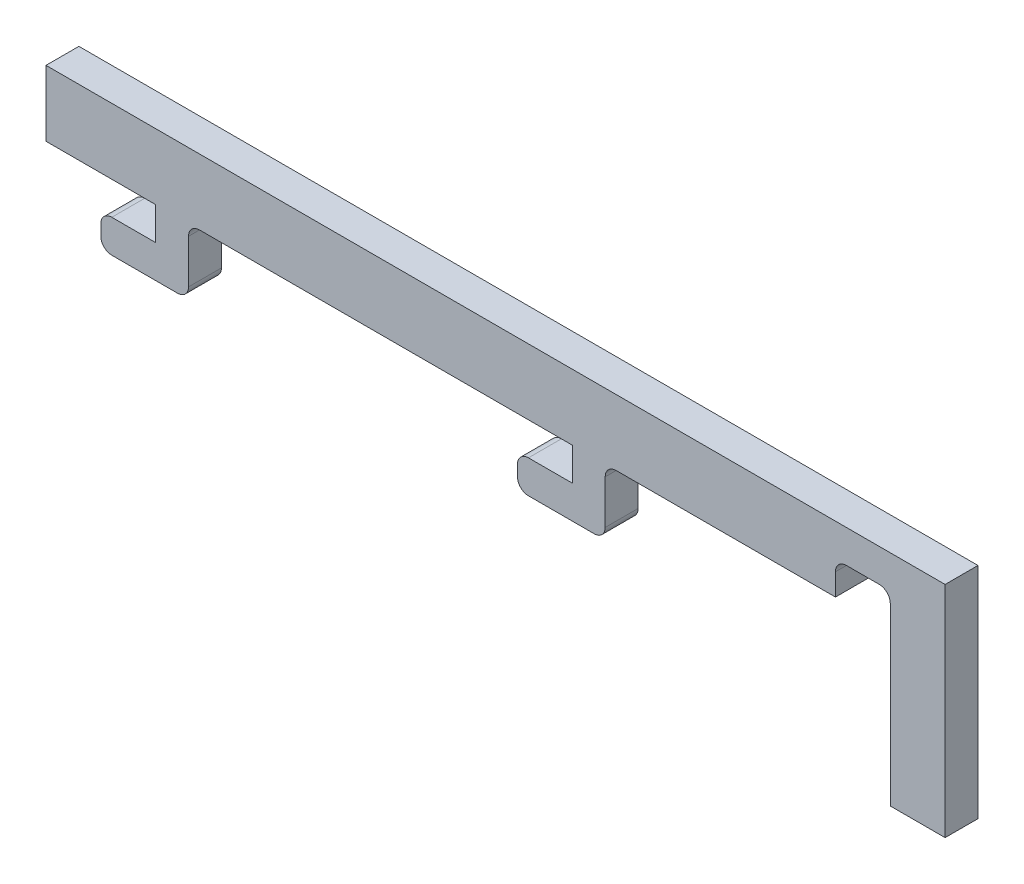
ISO-10303-21;
HEADER;
FILE_DESCRIPTION(('STEP AP214'),'2;1');
FILE_NAME('part.step','',(''),(''),'','','');
FILE_SCHEMA(('AUTOMOTIVE_DESIGN { 1 0 10303 214 1 1 1 1 }'));
ENDSEC;
DATA;
#1=APPLICATION_CONTEXT('core data for automotive mechanical design processes');
#2=APPLICATION_PROTOCOL_DEFINITION('international standard','automotive_design',2000,#1);
#3=PRODUCT_CONTEXT('',#1,'mechanical');
#4=PRODUCT('Part','Part','',(#3));
#5=PRODUCT_RELATED_PRODUCT_CATEGORY('part','',(#4));
#6=PRODUCT_DEFINITION_FORMATION('','',#4);
#7=PRODUCT_DEFINITION_CONTEXT('part definition',#1,'design');
#8=PRODUCT_DEFINITION('design','',#6,#7);
#9=PRODUCT_DEFINITION_SHAPE('','',#8);
#10=(LENGTH_UNIT() NAMED_UNIT(*) SI_UNIT(.MILLI.,.METRE.));
#11=(NAMED_UNIT(*) PLANE_ANGLE_UNIT() SI_UNIT($,.RADIAN.));
#12=(NAMED_UNIT(*) SI_UNIT($,.STERADIAN.) SOLID_ANGLE_UNIT());
#13=UNCERTAINTY_MEASURE_WITH_UNIT(LENGTH_MEASURE(1.E-05),#10,'distance_accuracy_value','');
#14=(GEOMETRIC_REPRESENTATION_CONTEXT(3) GLOBAL_UNCERTAINTY_ASSIGNED_CONTEXT((#13)) GLOBAL_UNIT_ASSIGNED_CONTEXT((#10,
#11,#12)) REPRESENTATION_CONTEXT('',''));
#15=CARTESIAN_POINT('',(0.,0.,0.));
#16=DIRECTION('',(0.,0.,1.));
#17=DIRECTION('',(1.,0.,0.));
#18=AXIS2_PLACEMENT_3D('',#15,#16,#17);
#19=CARTESIAN_POINT('',(-41.3834026689084,-2.,3.));
#20=DIRECTION('',(1.,0.,0.));
#21=DIRECTION('',(0.,1.,0.));
#22=AXIS2_PLACEMENT_3D('',#19,#20,#21);
#23=PLANE('',#22);
#24=DIRECTION('',(0.,-1.,0.));
#25=VECTOR('',#24,1.);
#26=CARTESIAN_POINT('',(-41.3834026689084,-2.,0.));
#27=LINE('',#26,#25);
#28=CARTESIAN_POINT('',(-41.3834026689085,4.00000000000006,0.));
#29=VERTEX_POINT('',#28);
#30=CARTESIAN_POINT('',(-41.3834026689084,-2.,0.));
#31=VERTEX_POINT('',#30);
#32=EDGE_CURVE('E276',#29,#31,#27,.T.);
#33=ORIENTED_EDGE('',*,*,#32,.T.);
#34=DIRECTION('',(0.,0.,-1.));
#35=VECTOR('',#34,1.);
#36=CARTESIAN_POINT('',(-41.3834026689084,-2.,3.));
#37=LINE('',#36,#35);
#38=CARTESIAN_POINT('',(-41.3834026689084,-2.,3.));
#39=VERTEX_POINT('',#38);
#40=EDGE_CURVE('E52',#39,#31,#37,.T.);
#41=ORIENTED_EDGE('',*,*,#40,.F.);
#42=DIRECTION('',(0.,-1.,0.));
#43=VECTOR('',#42,1.);
#44=CARTESIAN_POINT('',(-41.3834026689085,4.00000000000006,3.));
#45=LINE('',#44,#43);
#46=CARTESIAN_POINT('',(-41.3834026689085,4.00000000000006,3.));
#47=VERTEX_POINT('',#46);
#48=EDGE_CURVE('E586',#47,#39,#45,.T.);
#49=ORIENTED_EDGE('',*,*,#48,.F.);
#50=DIRECTION('',(0.,0.,-1.));
#51=VECTOR('',#50,1.);
#52=CARTESIAN_POINT('',(-41.3834026689085,4.00000000000006,3.));
#53=LINE('',#52,#51);
#54=EDGE_CURVE('E11',#47,#29,#53,.T.);
#55=ORIENTED_EDGE('',*,*,#54,.T.);
#56=EDGE_LOOP('',(#33,#41,#49,#55));
#57=FACE_BOUND('',#56,.T.);
#58=ADVANCED_FACE('F43',(#57),#23,.F.);
#59=CARTESIAN_POINT('',(-31.3834026689085,-2.,3.));
#60=DIRECTION('',(0.,1.,0.));
#61=DIRECTION('',(0.,0.,1.));
#62=AXIS2_PLACEMENT_3D('',#59,#60,#61);
#63=PLANE('',#62);
#64=DIRECTION('',(1.,0.,0.));
#65=VECTOR('',#64,1.);
#66=CARTESIAN_POINT('',(-31.3834026689085,-2.,0.));
#67=LINE('',#66,#65);
#68=CARTESIAN_POINT('',(-31.3834026689085,-2.,0.));
#69=VERTEX_POINT('',#68);
#70=EDGE_CURVE('E279',#31,#69,#67,.T.);
#71=ORIENTED_EDGE('',*,*,#70,.T.);
#72=DIRECTION('',(0.,0.,-1.));
#73=VECTOR('',#72,1.);
#74=CARTESIAN_POINT('',(-31.3834026689085,-2.,3.));
#75=LINE('',#74,#73);
#76=CARTESIAN_POINT('',(-31.3834026689085,-2.,3.));
#77=VERTEX_POINT('',#76);
#78=EDGE_CURVE('E461',#77,#69,#75,.T.);
#79=ORIENTED_EDGE('',*,*,#78,.F.);
#80=DIRECTION('',(1.,0.,0.));
#81=VECTOR('',#80,1.);
#82=CARTESIAN_POINT('',(-31.3834026689085,-2.,3.));
#83=LINE('',#82,#81);
#84=EDGE_CURVE('E472',#39,#77,#83,.T.);
#85=ORIENTED_EDGE('',*,*,#84,.F.);
#86=ORIENTED_EDGE('',*,*,#40,.T.);
#87=EDGE_LOOP('',(#71,#79,#85,#86));
#88=FACE_BOUND('',#87,.T.);
#89=ADVANCED_FACE('F470',(#88),#63,.F.);
#90=CARTESIAN_POINT('',(-31.3834026689085,-5.,3.));
#91=DIRECTION('',(1.,0.,0.));
#92=DIRECTION('',(0.,0.,-1.));
#93=AXIS2_PLACEMENT_3D('',#90,#91,#92);
#94=PLANE('',#93);
#95=DIRECTION('',(0.,-1.,0.));
#96=VECTOR('',#95,1.);
#97=CARTESIAN_POINT('',(-31.3834026689085,-5.,0.));
#98=LINE('',#97,#96);
#99=CARTESIAN_POINT('',(-31.3834026689085,-5.,0.));
#100=VERTEX_POINT('',#99);
#101=EDGE_CURVE('E282',#69,#100,#98,.T.);
#102=ORIENTED_EDGE('',*,*,#101,.T.);
#103=DIRECTION('',(0.,0.,-1.));
#104=VECTOR('',#103,1.);
#105=CARTESIAN_POINT('',(-31.3834026689085,-5.,3.));
#106=LINE('',#105,#104);
#107=CARTESIAN_POINT('',(-31.3834026689085,-5.,3.));
#108=VERTEX_POINT('',#107);
#109=EDGE_CURVE('E457',#108,#100,#106,.T.);
#110=ORIENTED_EDGE('',*,*,#109,.F.);
#111=DIRECTION('',(0.,-1.,0.));
#112=VECTOR('',#111,1.);
#113=CARTESIAN_POINT('',(-31.3834026689085,-5.,3.));
#114=LINE('',#113,#112);
#115=EDGE_CURVE('E494',#77,#108,#114,.T.);
#116=ORIENTED_EDGE('',*,*,#115,.F.);
#117=ORIENTED_EDGE('',*,*,#78,.T.);
#118=EDGE_LOOP('',(#102,#110,#116,#117));
#119=FACE_BOUND('',#118,.T.);
#120=ADVANCED_FACE('F484',(#119),#94,.F.);
#121=CARTESIAN_POINT('',(-35.3834026689085,-5.,3.));
#122=DIRECTION('',(0.,-1.,0.));
#123=DIRECTION('',(0.,0.,-1.));
#124=AXIS2_PLACEMENT_3D('',#121,#122,#123);
#125=PLANE('',#124);
#126=DIRECTION('',(-1.,0.,0.));
#127=VECTOR('',#126,1.);
#128=CARTESIAN_POINT('',(-35.3834026689085,-5.,0.));
#129=LINE('',#128,#127);
#130=CARTESIAN_POINT('',(-35.3834026689085,-5.,0.));
#131=VERTEX_POINT('',#130);
#132=EDGE_CURVE('E285',#100,#131,#129,.T.);
#133=ORIENTED_EDGE('',*,*,#132,.T.);
#134=DIRECTION('',(0.,0.,-1.));
#135=VECTOR('',#134,1.);
#136=CARTESIAN_POINT('',(-35.3834026689085,-5.,3.));
#137=LINE('',#136,#135);
#138=CARTESIAN_POINT('',(-35.3834026689085,-5.,3.));
#139=VERTEX_POINT('',#138);
#140=EDGE_CURVE('E453',#139,#131,#137,.T.);
#141=ORIENTED_EDGE('',*,*,#140,.F.);
#142=DIRECTION('',(-1.,0.,0.));
#143=VECTOR('',#142,1.);
#144=CARTESIAN_POINT('',(-35.3834026689085,-5.,3.));
#145=LINE('',#144,#143);
#146=EDGE_CURVE('E490',#108,#139,#145,.T.);
#147=ORIENTED_EDGE('',*,*,#146,.F.);
#148=ORIENTED_EDGE('',*,*,#109,.T.);
#149=EDGE_LOOP('',(#133,#141,#147,#148));
#150=FACE_BOUND('',#149,.T.);
#151=ADVANCED_FACE('F488',(#150),#125,.F.);
#152=CARTESIAN_POINT('',(-35.3834026689085,-6.00000000000001,3.));
#153=DIRECTION('',(0.,0.,-1.));
#154=DIRECTION('',(-1.,0.,0.));
#155=AXIS2_PLACEMENT_3D('',#152,#153,#154);
#156=CYLINDRICAL_SURFACE('',#155,1.);
#157=CARTESIAN_POINT('',(-35.3834026689085,-6.00000000000001,0.));
#158=DIRECTION('',(0.,0.,1.));
#159=DIRECTION('',(1.,0.,0.));
#160=AXIS2_PLACEMENT_3D('',#157,#158,#159);
#161=CIRCLE('',#160,1.);
#162=CARTESIAN_POINT('',(-36.3834026689085,-6.00000000000001,0.));
#163=VERTEX_POINT('',#162);
#164=EDGE_CURVE('E288',#131,#163,#161,.T.);
#165=ORIENTED_EDGE('',*,*,#164,.T.);
#166=DIRECTION('',(0.,0.,-1.));
#167=VECTOR('',#166,1.);
#168=CARTESIAN_POINT('',(-36.3834026689085,-6.00000000000001,3.));
#169=LINE('',#168,#167);
#170=CARTESIAN_POINT('',(-36.3834026689085,-6.00000000000001,3.));
#171=VERTEX_POINT('',#170);
#172=EDGE_CURVE('E449',#171,#163,#169,.T.);
#173=ORIENTED_EDGE('',*,*,#172,.F.);
#174=CARTESIAN_POINT('',(-35.3834026689085,-6.00000000000001,3.));
#175=DIRECTION('',(0.,0.,1.));
#176=DIRECTION('',(1.,0.,0.));
#177=AXIS2_PLACEMENT_3D('',#174,#175,#176);
#178=CIRCLE('',#177,1.);
#179=EDGE_CURVE('E493',#139,#171,#178,.T.);
#180=ORIENTED_EDGE('',*,*,#179,.F.);
#181=ORIENTED_EDGE('',*,*,#140,.T.);
#182=EDGE_LOOP('',(#165,#173,#180,#181));
#183=FACE_BOUND('',#182,.T.);
#184=ADVANCED_FACE('F599',(#183),#156,.T.);
#185=CARTESIAN_POINT('',(-36.3834026689085,-6.00000000000001,3.));
#186=DIRECTION('',(1.,0.,0.));
#187=DIRECTION('',(0.,0.,-1.));
#188=AXIS2_PLACEMENT_3D('',#185,#186,#187);
#189=PLANE('',#188);
#190=DIRECTION('',(0.,-1.,0.));
#191=VECTOR('',#190,1.);
#192=CARTESIAN_POINT('',(-36.3834026689085,-6.00000000000001,0.));
#193=LINE('',#192,#191);
#194=CARTESIAN_POINT('',(-36.3834026689085,-7.00000000000001,0.));
#195=VERTEX_POINT('',#194);
#196=EDGE_CURVE('E291',#163,#195,#193,.T.);
#197=ORIENTED_EDGE('',*,*,#196,.T.);
#198=DIRECTION('',(0.,0.,-1.));
#199=VECTOR('',#198,1.);
#200=CARTESIAN_POINT('',(-36.3834026689085,-7.00000000000001,3.));
#201=LINE('',#200,#199);
#202=CARTESIAN_POINT('',(-36.3834026689085,-7.00000000000001,3.));
#203=VERTEX_POINT('',#202);
#204=EDGE_CURVE('E445',#203,#195,#201,.T.);
#205=ORIENTED_EDGE('',*,*,#204,.F.);
#206=DIRECTION('',(0.,-1.,0.));
#207=VECTOR('',#206,1.);
#208=CARTESIAN_POINT('',(-36.3834026689085,-6.00000000000001,3.));
#209=LINE('',#208,#207);
#210=EDGE_CURVE('E498',#171,#203,#209,.T.);
#211=ORIENTED_EDGE('',*,*,#210,.F.);
#212=ORIENTED_EDGE('',*,*,#172,.T.);
#213=EDGE_LOOP('',(#197,#205,#211,#212));
#214=FACE_BOUND('',#213,.T.);
#215=ADVANCED_FACE('F602',(#214),#189,.F.);
#216=CARTESIAN_POINT('',(-35.3834026689085,-7.00000000000001,3.));
#217=DIRECTION('',(0.,0.,-1.));
#218=DIRECTION('',(-1.,0.,0.));
#219=AXIS2_PLACEMENT_3D('',#216,#217,#218);
#220=CYLINDRICAL_SURFACE('',#219,1.);
#221=CARTESIAN_POINT('',(-35.3834026689085,-7.00000000000001,0.));
#222=DIRECTION('',(0.,0.,1.));
#223=DIRECTION('',(1.,0.,0.));
#224=AXIS2_PLACEMENT_3D('',#221,#222,#223);
#225=CIRCLE('',#224,1.);
#226=CARTESIAN_POINT('',(-35.3834026689085,-8.00000000000001,0.));
#227=VERTEX_POINT('',#226);
#228=EDGE_CURVE('E294',#195,#227,#225,.T.);
#229=ORIENTED_EDGE('',*,*,#228,.T.);
#230=DIRECTION('',(0.,0.,-1.));
#231=VECTOR('',#230,1.);
#232=CARTESIAN_POINT('',(-35.3834026689085,-8.00000000000001,3.));
#233=LINE('',#232,#231);
#234=CARTESIAN_POINT('',(-35.3834026689085,-8.00000000000001,3.));
#235=VERTEX_POINT('',#234);
#236=EDGE_CURVE('E441',#235,#227,#233,.T.);
#237=ORIENTED_EDGE('',*,*,#236,.F.);
#238=CARTESIAN_POINT('',(-35.3834026689085,-7.00000000000001,3.));
#239=DIRECTION('',(0.,0.,1.));
#240=DIRECTION('',(1.,0.,0.));
#241=AXIS2_PLACEMENT_3D('',#238,#239,#240);
#242=CIRCLE('',#241,1.);
#243=EDGE_CURVE('E505',#203,#235,#242,.T.);
#244=ORIENTED_EDGE('',*,*,#243,.F.);
#245=ORIENTED_EDGE('',*,*,#204,.T.);
#246=EDGE_LOOP('',(#229,#237,#244,#245));
#247=FACE_BOUND('',#246,.T.);
#248=ADVANCED_FACE('F606',(#247),#220,.T.);
#249=CARTESIAN_POINT('',(-29.3834026689085,-8.00000000000001,3.));
#250=DIRECTION('',(0.,1.,0.));
#251=DIRECTION('',(0.,0.,1.));
#252=AXIS2_PLACEMENT_3D('',#249,#250,#251);
#253=PLANE('',#252);
#254=DIRECTION('',(1.,0.,0.));
#255=VECTOR('',#254,1.);
#256=CARTESIAN_POINT('',(-29.3834026689085,-8.00000000000001,0.));
#257=LINE('',#256,#255);
#258=CARTESIAN_POINT('',(-29.3834026689085,-8.00000000000001,0.));
#259=VERTEX_POINT('',#258);
#260=EDGE_CURVE('E297',#227,#259,#257,.T.);
#261=ORIENTED_EDGE('',*,*,#260,.T.);
#262=DIRECTION('',(0.,0.,-1.));
#263=VECTOR('',#262,1.);
#264=CARTESIAN_POINT('',(-29.3834026689085,-8.00000000000001,3.));
#265=LINE('',#264,#263);
#266=CARTESIAN_POINT('',(-29.3834026689085,-8.00000000000001,3.));
#267=VERTEX_POINT('',#266);
#268=EDGE_CURVE('E437',#267,#259,#265,.T.);
#269=ORIENTED_EDGE('',*,*,#268,.F.);
#270=DIRECTION('',(1.,0.,0.));
#271=VECTOR('',#270,1.);
#272=CARTESIAN_POINT('',(-29.3834026689085,-8.00000000000001,3.));
#273=LINE('',#272,#271);
#274=EDGE_CURVE('E508',#235,#267,#273,.T.);
#275=ORIENTED_EDGE('',*,*,#274,.F.);
#276=ORIENTED_EDGE('',*,*,#236,.T.);
#277=EDGE_LOOP('',(#261,#269,#275,#276));
#278=FACE_BOUND('',#277,.T.);
#279=ADVANCED_FACE('F610',(#278),#253,.F.);
#280=CARTESIAN_POINT('',(-29.3834026689085,-7.00000000000001,3.));
#281=DIRECTION('',(0.,0.,-1.));
#282=DIRECTION('',(-1.,0.,0.));
#283=AXIS2_PLACEMENT_3D('',#280,#281,#282);
#284=CYLINDRICAL_SURFACE('',#283,1.);
#285=CARTESIAN_POINT('',(-29.3834026689085,-7.00000000000001,0.));
#286=DIRECTION('',(0.,0.,1.));
#287=DIRECTION('',(1.,0.,0.));
#288=AXIS2_PLACEMENT_3D('',#285,#286,#287);
#289=CIRCLE('',#288,1.);
#290=CARTESIAN_POINT('',(-28.3834026689085,-7.00000000000001,0.));
#291=VERTEX_POINT('',#290);
#292=EDGE_CURVE('E300',#259,#291,#289,.T.);
#293=ORIENTED_EDGE('',*,*,#292,.T.);
#294=DIRECTION('',(0.,0.,-1.));
#295=VECTOR('',#294,1.);
#296=CARTESIAN_POINT('',(-28.3834026689085,-7.00000000000001,3.));
#297=LINE('',#296,#295);
#298=CARTESIAN_POINT('',(-28.3834026689085,-7.00000000000001,3.));
#299=VERTEX_POINT('',#298);
#300=EDGE_CURVE('E433',#299,#291,#297,.T.);
#301=ORIENTED_EDGE('',*,*,#300,.F.);
#302=CARTESIAN_POINT('',(-29.3834026689085,-7.00000000000001,3.));
#303=DIRECTION('',(0.,0.,1.));
#304=DIRECTION('',(1.,0.,0.));
#305=AXIS2_PLACEMENT_3D('',#302,#303,#304);
#306=CIRCLE('',#305,1.);
#307=EDGE_CURVE('E511',#267,#299,#306,.T.);
#308=ORIENTED_EDGE('',*,*,#307,.F.);
#309=ORIENTED_EDGE('',*,*,#268,.T.);
#310=EDGE_LOOP('',(#293,#301,#308,#309));
#311=FACE_BOUND('',#310,.T.);
#312=ADVANCED_FACE('F614',(#311),#284,.T.);
#313=CARTESIAN_POINT('',(-28.3834026689085,-7.00000000000001,3.));
#314=DIRECTION('',(-1.,0.,0.));
#315=DIRECTION('',(0.,0.,1.));
#316=AXIS2_PLACEMENT_3D('',#313,#314,#315);
#317=PLANE('',#316);
#318=DIRECTION('',(0.,1.,0.));
#319=VECTOR('',#318,1.);
#320=CARTESIAN_POINT('',(-28.3834026689085,-7.00000000000001,0.));
#321=LINE('',#320,#319);
#322=CARTESIAN_POINT('',(-28.3834026689085,-3.00000000000006,0.));
#323=VERTEX_POINT('',#322);
#324=EDGE_CURVE('E303',#291,#323,#321,.T.);
#325=ORIENTED_EDGE('',*,*,#324,.T.);
#326=DIRECTION('',(0.,0.,-1.));
#327=VECTOR('',#326,1.);
#328=CARTESIAN_POINT('',(-28.3834026689085,-3.00000000000006,3.));
#329=LINE('',#328,#327);
#330=CARTESIAN_POINT('',(-28.3834026689085,-3.00000000000006,3.));
#331=VERTEX_POINT('',#330);
#332=EDGE_CURVE('E429',#331,#323,#329,.T.);
#333=ORIENTED_EDGE('',*,*,#332,.F.);
#334=DIRECTION('',(0.,1.,0.));
#335=VECTOR('',#334,1.);
#336=CARTESIAN_POINT('',(-28.3834026689085,-7.00000000000001,3.));
#337=LINE('',#336,#335);
#338=EDGE_CURVE('E514',#299,#331,#337,.T.);
#339=ORIENTED_EDGE('',*,*,#338,.F.);
#340=ORIENTED_EDGE('',*,*,#300,.T.);
#341=EDGE_LOOP('',(#325,#333,#339,#340));
#342=FACE_BOUND('',#341,.T.);
#343=ADVANCED_FACE('F618',(#342),#317,.F.);
#344=CARTESIAN_POINT('',(-27.3834026689085,-3.00000000000006,3.));
#345=DIRECTION('',(0.,0.,-1.));
#346=DIRECTION('',(-1.,0.,0.));
#347=AXIS2_PLACEMENT_3D('',#344,#345,#346);
#348=CYLINDRICAL_SURFACE('',#347,1.);
#349=CARTESIAN_POINT('',(-27.3834026689085,-3.00000000000006,0.));
#350=DIRECTION('',(0.,0.,-1.));
#351=DIRECTION('',(1.,0.,0.));
#352=AXIS2_PLACEMENT_3D('',#349,#350,#351);
#353=CIRCLE('',#352,1.);
#354=CARTESIAN_POINT('',(-27.3834026689085,-2.00000000000006,0.));
#355=VERTEX_POINT('',#354);
#356=EDGE_CURVE('E306',#323,#355,#353,.T.);
#357=ORIENTED_EDGE('',*,*,#356,.T.);
#358=DIRECTION('',(0.,0.,-1.));
#359=VECTOR('',#358,1.);
#360=CARTESIAN_POINT('',(-27.3834026689085,-2.00000000000006,3.));
#361=LINE('',#360,#359);
#362=CARTESIAN_POINT('',(-27.3834026689085,-2.00000000000006,3.));
#363=VERTEX_POINT('',#362);
#364=EDGE_CURVE('E425',#363,#355,#361,.T.);
#365=ORIENTED_EDGE('',*,*,#364,.F.);
#366=CARTESIAN_POINT('',(-27.3834026689085,-3.00000000000006,3.));
#367=DIRECTION('',(0.,0.,-1.));
#368=DIRECTION('',(1.,0.,0.));
#369=AXIS2_PLACEMENT_3D('',#366,#367,#368);
#370=CIRCLE('',#369,1.);
#371=EDGE_CURVE('E517',#331,#363,#370,.T.);
#372=ORIENTED_EDGE('',*,*,#371,.F.);
#373=ORIENTED_EDGE('',*,*,#332,.T.);
#374=EDGE_LOOP('',(#357,#365,#372,#373));
#375=FACE_BOUND('',#374,.T.);
#376=ADVANCED_FACE('F622',(#375),#348,.F.);
#377=CARTESIAN_POINT('',(-27.3834026689085,-2.00000000000006,3.));
#378=DIRECTION('',(0.,1.,0.));
#379=DIRECTION('',(0.,0.,1.));
#380=AXIS2_PLACEMENT_3D('',#377,#378,#379);
#381=PLANE('',#380);
#382=DIRECTION('',(1.,0.,0.));
#383=VECTOR('',#382,1.);
#384=CARTESIAN_POINT('',(-27.3834026689085,-2.00000000000006,0.));
#385=LINE('',#384,#383);
#386=CARTESIAN_POINT('',(6.61659733109146,-2.00000000000006,0.));
#387=VERTEX_POINT('',#386);
#388=EDGE_CURVE('E309',#355,#387,#385,.T.);
#389=ORIENTED_EDGE('',*,*,#388,.T.);
#390=DIRECTION('',(0.,0.,-1.));
#391=VECTOR('',#390,1.);
#392=CARTESIAN_POINT('',(6.61659733109146,-2.00000000000006,3.));
#393=LINE('',#392,#391);
#394=CARTESIAN_POINT('',(6.61659733109146,-2.00000000000006,3.));
#395=VERTEX_POINT('',#394);
#396=EDGE_CURVE('E421',#395,#387,#393,.T.);
#397=ORIENTED_EDGE('',*,*,#396,.F.);
#398=DIRECTION('',(1.,0.,0.));
#399=VECTOR('',#398,1.);
#400=CARTESIAN_POINT('',(-27.3834026689085,-2.00000000000006,3.));
#401=LINE('',#400,#399);
#402=EDGE_CURVE('E520',#363,#395,#401,.T.);
#403=ORIENTED_EDGE('',*,*,#402,.F.);
#404=ORIENTED_EDGE('',*,*,#364,.T.);
#405=EDGE_LOOP('',(#389,#397,#403,#404));
#406=FACE_BOUND('',#405,.T.);
#407=ADVANCED_FACE('F626',(#406),#381,.F.);
#408=CARTESIAN_POINT('',(6.61659733109146,-5.,3.));
#409=DIRECTION('',(1.,0.,0.));
#410=DIRECTION('',(0.,0.,-1.));
#411=AXIS2_PLACEMENT_3D('',#408,#409,#410);
#412=PLANE('',#411);
#413=DIRECTION('',(0.,-1.,0.));
#414=VECTOR('',#413,1.);
#415=CARTESIAN_POINT('',(6.61659733109146,-5.,0.));
#416=LINE('',#415,#414);
#417=CARTESIAN_POINT('',(6.61659733109146,-5.,0.));
#418=VERTEX_POINT('',#417);
#419=EDGE_CURVE('E312',#387,#418,#416,.T.);
#420=ORIENTED_EDGE('',*,*,#419,.T.);
#421=DIRECTION('',(0.,0.,-1.));
#422=VECTOR('',#421,1.);
#423=CARTESIAN_POINT('',(6.61659733109146,-5.,3.));
#424=LINE('',#423,#422);
#425=CARTESIAN_POINT('',(6.61659733109146,-5.,3.));
#426=VERTEX_POINT('',#425);
#427=EDGE_CURVE('E417',#426,#418,#424,.T.);
#428=ORIENTED_EDGE('',*,*,#427,.F.);
#429=DIRECTION('',(0.,-1.,0.));
#430=VECTOR('',#429,1.);
#431=CARTESIAN_POINT('',(6.61659733109146,-5.,3.));
#432=LINE('',#431,#430);
#433=EDGE_CURVE('E523',#395,#426,#432,.T.);
#434=ORIENTED_EDGE('',*,*,#433,.F.);
#435=ORIENTED_EDGE('',*,*,#396,.T.);
#436=EDGE_LOOP('',(#420,#428,#434,#435));
#437=FACE_BOUND('',#436,.T.);
#438=ADVANCED_FACE('F630',(#437),#412,.F.);
#439=CARTESIAN_POINT('',(2.61659733109149,-5.,3.));
#440=DIRECTION('',(0.,-1.,0.));
#441=DIRECTION('',(0.,0.,-1.));
#442=AXIS2_PLACEMENT_3D('',#439,#440,#441);
#443=PLANE('',#442);
#444=DIRECTION('',(-1.,0.,0.));
#445=VECTOR('',#444,1.);
#446=CARTESIAN_POINT('',(2.61659733109149,-5.,0.));
#447=LINE('',#446,#445);
#448=CARTESIAN_POINT('',(2.61659733109149,-5.,0.));
#449=VERTEX_POINT('',#448);
#450=EDGE_CURVE('E315',#418,#449,#447,.T.);
#451=ORIENTED_EDGE('',*,*,#450,.T.);
#452=DIRECTION('',(0.,0.,-1.));
#453=VECTOR('',#452,1.);
#454=CARTESIAN_POINT('',(2.61659733109149,-5.,3.));
#455=LINE('',#454,#453);
#456=CARTESIAN_POINT('',(2.61659733109149,-5.,3.));
#457=VERTEX_POINT('',#456);
#458=EDGE_CURVE('E413',#457,#449,#455,.T.);
#459=ORIENTED_EDGE('',*,*,#458,.F.);
#460=DIRECTION('',(-1.,0.,0.));
#461=VECTOR('',#460,1.);
#462=CARTESIAN_POINT('',(2.61659733109149,-5.,3.));
#463=LINE('',#462,#461);
#464=EDGE_CURVE('E526',#426,#457,#463,.T.);
#465=ORIENTED_EDGE('',*,*,#464,.F.);
#466=ORIENTED_EDGE('',*,*,#427,.T.);
#467=EDGE_LOOP('',(#451,#459,#465,#466));
#468=FACE_BOUND('',#467,.T.);
#469=ADVANCED_FACE('F634',(#468),#443,.F.);
#470=CARTESIAN_POINT('',(2.61659733109149,-6.00000000000001,3.));
#471=DIRECTION('',(0.,0.,-1.));
#472=DIRECTION('',(-1.,0.,0.));
#473=AXIS2_PLACEMENT_3D('',#470,#471,#472);
#474=CYLINDRICAL_SURFACE('',#473,1.);
#475=CARTESIAN_POINT('',(2.61659733109149,-6.00000000000001,0.));
#476=DIRECTION('',(0.,0.,1.));
#477=DIRECTION('',(1.,0.,0.));
#478=AXIS2_PLACEMENT_3D('',#475,#476,#477);
#479=CIRCLE('',#478,1.);
#480=CARTESIAN_POINT('',(1.61659733109148,-6.00000000000001,0.));
#481=VERTEX_POINT('',#480);
#482=EDGE_CURVE('E318',#449,#481,#479,.T.);
#483=ORIENTED_EDGE('',*,*,#482,.T.);
#484=DIRECTION('',(0.,0.,-1.));
#485=VECTOR('',#484,1.);
#486=CARTESIAN_POINT('',(1.61659733109148,-6.00000000000001,3.));
#487=LINE('',#486,#485);
#488=CARTESIAN_POINT('',(1.61659733109148,-6.00000000000001,3.));
#489=VERTEX_POINT('',#488);
#490=EDGE_CURVE('E409',#489,#481,#487,.T.);
#491=ORIENTED_EDGE('',*,*,#490,.F.);
#492=CARTESIAN_POINT('',(2.61659733109149,-6.00000000000001,3.));
#493=DIRECTION('',(0.,0.,1.));
#494=DIRECTION('',(1.,0.,0.));
#495=AXIS2_PLACEMENT_3D('',#492,#493,#494);
#496=CIRCLE('',#495,1.);
#497=EDGE_CURVE('E529',#457,#489,#496,.T.);
#498=ORIENTED_EDGE('',*,*,#497,.F.);
#499=ORIENTED_EDGE('',*,*,#458,.T.);
#500=EDGE_LOOP('',(#483,#491,#498,#499));
#501=FACE_BOUND('',#500,.T.);
#502=ADVANCED_FACE('F638',(#501),#474,.T.);
#503=CARTESIAN_POINT('',(1.61659733109148,-6.00000000000001,3.));
#504=DIRECTION('',(1.,0.,0.));
#505=DIRECTION('',(0.,0.,-1.));
#506=AXIS2_PLACEMENT_3D('',#503,#504,#505);
#507=PLANE('',#506);
#508=DIRECTION('',(0.,-1.,0.));
#509=VECTOR('',#508,1.);
#510=CARTESIAN_POINT('',(1.61659733109148,-6.00000000000001,0.));
#511=LINE('',#510,#509);
#512=CARTESIAN_POINT('',(1.61659733109148,-7.00000000000006,0.));
#513=VERTEX_POINT('',#512);
#514=EDGE_CURVE('E321',#481,#513,#511,.T.);
#515=ORIENTED_EDGE('',*,*,#514,.T.);
#516=DIRECTION('',(0.,0.,-1.));
#517=VECTOR('',#516,1.);
#518=CARTESIAN_POINT('',(1.61659733109148,-7.00000000000006,3.));
#519=LINE('',#518,#517);
#520=CARTESIAN_POINT('',(1.61659733109148,-7.00000000000006,3.));
#521=VERTEX_POINT('',#520);
#522=EDGE_CURVE('E405',#521,#513,#519,.T.);
#523=ORIENTED_EDGE('',*,*,#522,.F.);
#524=DIRECTION('',(0.,-1.,0.));
#525=VECTOR('',#524,1.);
#526=CARTESIAN_POINT('',(1.61659733109148,-6.00000000000001,3.));
#527=LINE('',#526,#525);
#528=EDGE_CURVE('E532',#489,#521,#527,.T.);
#529=ORIENTED_EDGE('',*,*,#528,.F.);
#530=ORIENTED_EDGE('',*,*,#490,.T.);
#531=EDGE_LOOP('',(#515,#523,#529,#530));
#532=FACE_BOUND('',#531,.T.);
#533=ADVANCED_FACE('F642',(#532),#507,.F.);
#534=CARTESIAN_POINT('',(2.61659733109149,-7.00000000000006,3.));
#535=DIRECTION('',(0.,0.,-1.));
#536=DIRECTION('',(-1.,0.,0.));
#537=AXIS2_PLACEMENT_3D('',#534,#535,#536);
#538=CYLINDRICAL_SURFACE('',#537,1.);
#539=CARTESIAN_POINT('',(2.61659733109149,-7.00000000000006,0.));
#540=DIRECTION('',(0.,0.,1.));
#541=DIRECTION('',(1.,0.,0.));
#542=AXIS2_PLACEMENT_3D('',#539,#540,#541);
#543=CIRCLE('',#542,1.);
#544=CARTESIAN_POINT('',(2.61659733109149,-8.00000000000006,0.));
#545=VERTEX_POINT('',#544);
#546=EDGE_CURVE('E324',#513,#545,#543,.T.);
#547=ORIENTED_EDGE('',*,*,#546,.T.);
#548=DIRECTION('',(0.,0.,-1.));
#549=VECTOR('',#548,1.);
#550=CARTESIAN_POINT('',(2.61659733109149,-8.00000000000006,3.));
#551=LINE('',#550,#549);
#552=CARTESIAN_POINT('',(2.61659733109149,-8.00000000000006,3.));
#553=VERTEX_POINT('',#552);
#554=EDGE_CURVE('E401',#553,#545,#551,.T.);
#555=ORIENTED_EDGE('',*,*,#554,.F.);
#556=CARTESIAN_POINT('',(2.61659733109149,-7.00000000000006,3.));
#557=DIRECTION('',(0.,0.,1.));
#558=DIRECTION('',(1.,0.,0.));
#559=AXIS2_PLACEMENT_3D('',#556,#557,#558);
#560=CIRCLE('',#559,1.);
#561=EDGE_CURVE('E535',#521,#553,#560,.T.);
#562=ORIENTED_EDGE('',*,*,#561,.F.);
#563=ORIENTED_EDGE('',*,*,#522,.T.);
#564=EDGE_LOOP('',(#547,#555,#562,#563));
#565=FACE_BOUND('',#564,.T.);
#566=ADVANCED_FACE('F646',(#565),#538,.T.);
#567=CARTESIAN_POINT('',(8.61659733109146,-8.00000000000006,3.));
#568=DIRECTION('',(0.,1.,0.));
#569=DIRECTION('',(0.,0.,1.));
#570=AXIS2_PLACEMENT_3D('',#567,#568,#569);
#571=PLANE('',#570);
#572=DIRECTION('',(1.,0.,0.));
#573=VECTOR('',#572,1.);
#574=CARTESIAN_POINT('',(8.61659733109146,-8.00000000000006,0.));
#575=LINE('',#574,#573);
#576=CARTESIAN_POINT('',(8.61659733109146,-8.00000000000006,0.));
#577=VERTEX_POINT('',#576);
#578=EDGE_CURVE('E327',#545,#577,#575,.T.);
#579=ORIENTED_EDGE('',*,*,#578,.T.);
#580=DIRECTION('',(0.,0.,-1.));
#581=VECTOR('',#580,1.);
#582=CARTESIAN_POINT('',(8.61659733109146,-8.00000000000006,3.));
#583=LINE('',#582,#581);
#584=CARTESIAN_POINT('',(8.61659733109146,-8.00000000000006,3.));
#585=VERTEX_POINT('',#584);
#586=EDGE_CURVE('E397',#585,#577,#583,.T.);
#587=ORIENTED_EDGE('',*,*,#586,.F.);
#588=DIRECTION('',(1.,0.,0.));
#589=VECTOR('',#588,1.);
#590=CARTESIAN_POINT('',(8.61659733109146,-8.00000000000006,3.));
#591=LINE('',#590,#589);
#592=EDGE_CURVE('E538',#553,#585,#591,.T.);
#593=ORIENTED_EDGE('',*,*,#592,.F.);
#594=ORIENTED_EDGE('',*,*,#554,.T.);
#595=EDGE_LOOP('',(#579,#587,#593,#594));
#596=FACE_BOUND('',#595,.T.);
#597=ADVANCED_FACE('F650',(#596),#571,.F.);
#598=CARTESIAN_POINT('',(8.61659733109146,-7.00000000000006,3.));
#599=DIRECTION('',(0.,0.,-1.));
#600=DIRECTION('',(-1.,0.,0.));
#601=AXIS2_PLACEMENT_3D('',#598,#599,#600);
#602=CYLINDRICAL_SURFACE('',#601,1.);
#603=CARTESIAN_POINT('',(8.61659733109146,-7.00000000000006,0.));
#604=DIRECTION('',(0.,0.,1.));
#605=DIRECTION('',(1.,0.,0.));
#606=AXIS2_PLACEMENT_3D('',#603,#604,#605);
#607=CIRCLE('',#606,1.);
#608=CARTESIAN_POINT('',(9.61659733109146,-7.00000000000006,0.));
#609=VERTEX_POINT('',#608);
#610=EDGE_CURVE('E330',#577,#609,#607,.T.);
#611=ORIENTED_EDGE('',*,*,#610,.T.);
#612=DIRECTION('',(0.,0.,-1.));
#613=VECTOR('',#612,1.);
#614=CARTESIAN_POINT('',(9.61659733109146,-7.00000000000006,3.));
#615=LINE('',#614,#613);
#616=CARTESIAN_POINT('',(9.61659733109146,-7.00000000000006,3.));
#617=VERTEX_POINT('',#616);
#618=EDGE_CURVE('E393',#617,#609,#615,.T.);
#619=ORIENTED_EDGE('',*,*,#618,.F.);
#620=CARTESIAN_POINT('',(8.61659733109146,-7.00000000000006,3.));
#621=DIRECTION('',(0.,0.,1.));
#622=DIRECTION('',(1.,0.,0.));
#623=AXIS2_PLACEMENT_3D('',#620,#621,#622);
#624=CIRCLE('',#623,1.);
#625=EDGE_CURVE('E541',#585,#617,#624,.T.);
#626=ORIENTED_EDGE('',*,*,#625,.F.);
#627=ORIENTED_EDGE('',*,*,#586,.T.);
#628=EDGE_LOOP('',(#611,#619,#626,#627));
#629=FACE_BOUND('',#628,.T.);
#630=ADVANCED_FACE('F654',(#629),#602,.T.);
#631=CARTESIAN_POINT('',(9.61659733109146,-7.00000000000006,3.));
#632=DIRECTION('',(-1.,0.,0.));
#633=DIRECTION('',(0.,0.,1.));
#634=AXIS2_PLACEMENT_3D('',#631,#632,#633);
#635=PLANE('',#634);
#636=DIRECTION('',(0.,1.,0.));
#637=VECTOR('',#636,1.);
#638=CARTESIAN_POINT('',(9.61659733109146,-7.00000000000006,0.));
#639=LINE('',#638,#637);
#640=CARTESIAN_POINT('',(9.61659733109146,-3.00000000000006,0.));
#641=VERTEX_POINT('',#640);
#642=EDGE_CURVE('E333',#609,#641,#639,.T.);
#643=ORIENTED_EDGE('',*,*,#642,.T.);
#644=DIRECTION('',(0.,0.,-1.));
#645=VECTOR('',#644,1.);
#646=CARTESIAN_POINT('',(9.61659733109146,-3.00000000000006,3.));
#647=LINE('',#646,#645);
#648=CARTESIAN_POINT('',(9.61659733109146,-3.00000000000006,3.));
#649=VERTEX_POINT('',#648);
#650=EDGE_CURVE('E389',#649,#641,#647,.T.);
#651=ORIENTED_EDGE('',*,*,#650,.F.);
#652=DIRECTION('',(0.,1.,0.));
#653=VECTOR('',#652,1.);
#654=CARTESIAN_POINT('',(9.61659733109146,-7.00000000000006,3.));
#655=LINE('',#654,#653);
#656=EDGE_CURVE('E544',#617,#649,#655,.T.);
#657=ORIENTED_EDGE('',*,*,#656,.F.);
#658=ORIENTED_EDGE('',*,*,#618,.T.);
#659=EDGE_LOOP('',(#643,#651,#657,#658));
#660=FACE_BOUND('',#659,.T.);
#661=ADVANCED_FACE('F658',(#660),#635,.F.);
#662=CARTESIAN_POINT('',(10.6165973310915,-3.00000000000006,3.));
#663=DIRECTION('',(0.,0.,-1.));
#664=DIRECTION('',(-1.,0.,0.));
#665=AXIS2_PLACEMENT_3D('',#662,#663,#664);
#666=CYLINDRICAL_SURFACE('',#665,1.);
#667=CARTESIAN_POINT('',(10.6165973310915,-3.00000000000006,0.));
#668=DIRECTION('',(0.,0.,-1.));
#669=DIRECTION('',(1.,0.,0.));
#670=AXIS2_PLACEMENT_3D('',#667,#668,#669);
#671=CIRCLE('',#670,1.);
#672=CARTESIAN_POINT('',(10.6165973310915,-2.00000000000006,0.));
#673=VERTEX_POINT('',#672);
#674=EDGE_CURVE('E336',#641,#673,#671,.T.);
#675=ORIENTED_EDGE('',*,*,#674,.T.);
#676=DIRECTION('',(0.,0.,-1.));
#677=VECTOR('',#676,1.);
#678=CARTESIAN_POINT('',(10.6165973310915,-2.00000000000006,3.));
#679=LINE('',#678,#677);
#680=CARTESIAN_POINT('',(10.6165973310915,-2.00000000000006,3.));
#681=VERTEX_POINT('',#680);
#682=EDGE_CURVE('E385',#681,#673,#679,.T.);
#683=ORIENTED_EDGE('',*,*,#682,.F.);
#684=CARTESIAN_POINT('',(10.6165973310915,-3.00000000000006,3.));
#685=DIRECTION('',(0.,0.,-1.));
#686=DIRECTION('',(1.,0.,0.));
#687=AXIS2_PLACEMENT_3D('',#684,#685,#686);
#688=CIRCLE('',#687,1.);
#689=EDGE_CURVE('E547',#649,#681,#688,.T.);
#690=ORIENTED_EDGE('',*,*,#689,.F.);
#691=ORIENTED_EDGE('',*,*,#650,.T.);
#692=EDGE_LOOP('',(#675,#683,#690,#691));
#693=FACE_BOUND('',#692,.T.);
#694=ADVANCED_FACE('F662',(#693),#666,.F.);
#695=CARTESIAN_POINT('',(30.6165973310915,-2.00000000000006,3.));
#696=DIRECTION('',(0.,1.,0.));
#697=DIRECTION('',(0.,0.,1.));
#698=AXIS2_PLACEMENT_3D('',#695,#696,#697);
#699=PLANE('',#698);
#700=DIRECTION('',(1.,0.,0.));
#701=VECTOR('',#700,1.);
#702=CARTESIAN_POINT('',(30.6165973310915,-2.00000000000006,0.));
#703=LINE('',#702,#701);
#704=CARTESIAN_POINT('',(30.6165973310915,-2.00000000000006,0.));
#705=VERTEX_POINT('',#704);
#706=EDGE_CURVE('E339',#673,#705,#703,.T.);
#707=ORIENTED_EDGE('',*,*,#706,.T.);
#708=DIRECTION('',(0.,0.,-1.));
#709=VECTOR('',#708,1.);
#710=CARTESIAN_POINT('',(30.6165973310915,-2.00000000000006,3.));
#711=LINE('',#710,#709);
#712=CARTESIAN_POINT('',(30.6165973310915,-2.00000000000006,3.));
#713=VERTEX_POINT('',#712);
#714=EDGE_CURVE('E381',#713,#705,#711,.T.);
#715=ORIENTED_EDGE('',*,*,#714,.F.);
#716=DIRECTION('',(1.,0.,0.));
#717=VECTOR('',#716,1.);
#718=CARTESIAN_POINT('',(30.6165973310915,-2.00000000000006,3.));
#719=LINE('',#718,#717);
#720=EDGE_CURVE('E550',#681,#713,#719,.T.);
#721=ORIENTED_EDGE('',*,*,#720,.F.);
#722=ORIENTED_EDGE('',*,*,#682,.T.);
#723=EDGE_LOOP('',(#707,#715,#721,#722));
#724=FACE_BOUND('',#723,.T.);
#725=ADVANCED_FACE('F666',(#724),#699,.F.);
#726=CARTESIAN_POINT('',(30.6165973310915,0.,3.));
#727=DIRECTION('',(-1.,0.,0.));
#728=DIRECTION('',(0.,0.,1.));
#729=AXIS2_PLACEMENT_3D('',#726,#727,#728);
#730=PLANE('',#729);
#731=DIRECTION('',(0.,1.,0.));
#732=VECTOR('',#731,1.);
#733=CARTESIAN_POINT('',(30.6165973310915,0.,0.));
#734=LINE('',#733,#732);
#735=CARTESIAN_POINT('',(30.6165973310915,0.,0.));
#736=VERTEX_POINT('',#735);
#737=EDGE_CURVE('E342',#705,#736,#734,.T.);
#738=ORIENTED_EDGE('',*,*,#737,.T.);
#739=DIRECTION('',(0.,0.,-1.));
#740=VECTOR('',#739,1.);
#741=CARTESIAN_POINT('',(30.6165973310915,0.,3.));
#742=LINE('',#741,#740);
#743=CARTESIAN_POINT('',(30.6165973310915,0.,3.));
#744=VERTEX_POINT('',#743);
#745=EDGE_CURVE('E377',#744,#736,#742,.T.);
#746=ORIENTED_EDGE('',*,*,#745,.F.);
#747=DIRECTION('',(0.,1.,0.));
#748=VECTOR('',#747,1.);
#749=CARTESIAN_POINT('',(30.6165973310915,0.,3.));
#750=LINE('',#749,#748);
#751=EDGE_CURVE('E553',#713,#744,#750,.T.);
#752=ORIENTED_EDGE('',*,*,#751,.F.);
#753=ORIENTED_EDGE('',*,*,#714,.T.);
#754=EDGE_LOOP('',(#738,#746,#752,#753));
#755=FACE_BOUND('',#754,.T.);
#756=ADVANCED_FACE('F670',(#755),#730,.F.);
#757=CARTESIAN_POINT('',(31.6165973310915,0.,3.));
#758=DIRECTION('',(0.,0.,-1.));
#759=DIRECTION('',(-1.,0.,0.));
#760=AXIS2_PLACEMENT_3D('',#757,#758,#759);
#761=CYLINDRICAL_SURFACE('',#760,1.);
#762=CARTESIAN_POINT('',(31.6165973310915,0.,0.));
#763=DIRECTION('',(0.,0.,-1.));
#764=DIRECTION('',(1.,0.,0.));
#765=AXIS2_PLACEMENT_3D('',#762,#763,#764);
#766=CIRCLE('',#765,1.);
#767=CARTESIAN_POINT('',(31.6165973310915,1.,0.));
#768=VERTEX_POINT('',#767);
#769=EDGE_CURVE('E345',#736,#768,#766,.T.);
#770=ORIENTED_EDGE('',*,*,#769,.T.);
#771=DIRECTION('',(0.,0.,-1.));
#772=VECTOR('',#771,1.);
#773=CARTESIAN_POINT('',(31.6165973310915,1.,3.));
#774=LINE('',#773,#772);
#775=CARTESIAN_POINT('',(31.6165973310915,1.,3.));
#776=VERTEX_POINT('',#775);
#777=EDGE_CURVE('E373',#776,#768,#774,.T.);
#778=ORIENTED_EDGE('',*,*,#777,.F.);
#779=CARTESIAN_POINT('',(31.6165973310915,0.,3.));
#780=DIRECTION('',(0.,0.,-1.));
#781=DIRECTION('',(1.,0.,0.));
#782=AXIS2_PLACEMENT_3D('',#779,#780,#781);
#783=CIRCLE('',#782,1.);
#784=EDGE_CURVE('E556',#744,#776,#783,.T.);
#785=ORIENTED_EDGE('',*,*,#784,.F.);
#786=ORIENTED_EDGE('',*,*,#745,.T.);
#787=EDGE_LOOP('',(#770,#778,#785,#786));
#788=FACE_BOUND('',#787,.T.);
#789=ADVANCED_FACE('F674',(#788),#761,.F.);
#790=CARTESIAN_POINT('',(31.6165973310915,1.,3.));
#791=DIRECTION('',(0.,1.,0.));
#792=DIRECTION('',(0.,0.,1.));
#793=AXIS2_PLACEMENT_3D('',#790,#791,#792);
#794=PLANE('',#793);
#795=DIRECTION('',(1.,0.,0.));
#796=VECTOR('',#795,1.);
#797=CARTESIAN_POINT('',(31.6165973310915,1.,0.));
#798=LINE('',#797,#796);
#799=CARTESIAN_POINT('',(34.6165973310915,1.,0.));
#800=VERTEX_POINT('',#799);
#801=EDGE_CURVE('E348',#768,#800,#798,.T.);
#802=ORIENTED_EDGE('',*,*,#801,.T.);
#803=DIRECTION('',(0.,0.,-1.));
#804=VECTOR('',#803,1.);
#805=CARTESIAN_POINT('',(34.6165973310915,1.,3.));
#806=LINE('',#805,#804);
#807=CARTESIAN_POINT('',(34.6165973310915,1.,3.));
#808=VERTEX_POINT('',#807);
#809=EDGE_CURVE('E369',#808,#800,#806,.T.);
#810=ORIENTED_EDGE('',*,*,#809,.F.);
#811=DIRECTION('',(1.,0.,0.));
#812=VECTOR('',#811,1.);
#813=CARTESIAN_POINT('',(31.6165973310915,1.,3.));
#814=LINE('',#813,#812);
#815=EDGE_CURVE('E559',#776,#808,#814,.T.);
#816=ORIENTED_EDGE('',*,*,#815,.F.);
#817=ORIENTED_EDGE('',*,*,#777,.T.);
#818=EDGE_LOOP('',(#802,#810,#816,#817));
#819=FACE_BOUND('',#818,.T.);
#820=ADVANCED_FACE('F567',(#819),#794,.F.);
#821=CARTESIAN_POINT('',(34.6165973310915,0.,3.));
#822=DIRECTION('',(0.,0.,-1.));
#823=DIRECTION('',(-1.,0.,0.));
#824=AXIS2_PLACEMENT_3D('',#821,#822,#823);
#825=CYLINDRICAL_SURFACE('',#824,1.);
#826=CARTESIAN_POINT('',(34.6165973310915,0.,0.));
#827=DIRECTION('',(0.,0.,-1.));
#828=DIRECTION('',(1.,0.,0.));
#829=AXIS2_PLACEMENT_3D('',#826,#827,#828);
#830=CIRCLE('',#829,1.);
#831=CARTESIAN_POINT('',(35.6165973310915,0.,0.));
#832=VERTEX_POINT('',#831);
#833=EDGE_CURVE('E351',#800,#832,#830,.T.);
#834=ORIENTED_EDGE('',*,*,#833,.T.);
#835=DIRECTION('',(0.,0.,-1.));
#836=VECTOR('',#835,1.);
#837=CARTESIAN_POINT('',(35.6165973310915,0.,3.));
#838=LINE('',#837,#836);
#839=CARTESIAN_POINT('',(35.6165973310915,0.,3.));
#840=VERTEX_POINT('',#839);
#841=EDGE_CURVE('E263',#840,#832,#838,.T.);
#842=ORIENTED_EDGE('',*,*,#841,.F.);
#843=CARTESIAN_POINT('',(34.6165973310915,0.,3.));
#844=DIRECTION('',(0.,0.,-1.));
#845=DIRECTION('',(1.,0.,0.));
#846=AXIS2_PLACEMENT_3D('',#843,#844,#845);
#847=CIRCLE('',#846,1.);
#848=EDGE_CURVE('E252',#808,#840,#847,.T.);
#849=ORIENTED_EDGE('',*,*,#848,.F.);
#850=ORIENTED_EDGE('',*,*,#809,.T.);
#851=EDGE_LOOP('',(#834,#842,#849,#850));
#852=FACE_BOUND('',#851,.T.);
#853=ADVANCED_FACE('F571',(#852),#825,.F.);
#854=CARTESIAN_POINT('',(35.6165973310915,-16.,3.));
#855=DIRECTION('',(1.,0.,0.));
#856=DIRECTION('',(0.,0.,-1.));
#857=AXIS2_PLACEMENT_3D('',#854,#855,#856);
#858=PLANE('',#857);
#859=DIRECTION('',(0.,-1.,0.));
#860=VECTOR('',#859,1.);
#861=CARTESIAN_POINT('',(35.6165973310915,-16.,0.));
#862=LINE('',#861,#860);
#863=CARTESIAN_POINT('',(35.6165973310915,-16.,0.));
#864=VERTEX_POINT('',#863);
#865=EDGE_CURVE('E261',#832,#864,#862,.T.);
#866=ORIENTED_EDGE('',*,*,#865,.T.);
#867=DIRECTION('',(0.,0.,-1.));
#868=VECTOR('',#867,1.);
#869=CARTESIAN_POINT('',(35.6165973310915,-16.,3.));
#870=LINE('',#869,#868);
#871=CARTESIAN_POINT('',(35.6165973310915,-16.,3.));
#872=VERTEX_POINT('',#871);
#873=EDGE_CURVE('E258',#872,#864,#870,.T.);
#874=ORIENTED_EDGE('',*,*,#873,.F.);
#875=DIRECTION('',(0.,-1.,0.));
#876=VECTOR('',#875,1.);
#877=CARTESIAN_POINT('',(35.6165973310915,-16.,3.));
#878=LINE('',#877,#876);
#879=EDGE_CURVE('E246',#840,#872,#878,.T.);
#880=ORIENTED_EDGE('',*,*,#879,.F.);
#881=ORIENTED_EDGE('',*,*,#841,.T.);
#882=EDGE_LOOP('',(#866,#874,#880,#881));
#883=FACE_BOUND('',#882,.T.);
#884=ADVANCED_FACE('F259',(#883),#858,.F.);
#885=CARTESIAN_POINT('',(40.6165973310915,-15.9999999999999,3.));
#886=DIRECTION('',(0.,1.,0.));
#887=DIRECTION('',(-1.,0.,0.));
#888=AXIS2_PLACEMENT_3D('',#885,#886,#887);
#889=PLANE('',#888);
#890=DIRECTION('',(1.,0.,0.));
#891=VECTOR('',#890,1.);
#892=CARTESIAN_POINT('',(40.6165973310915,-15.9999999999999,0.));
#893=LINE('',#892,#891);
#894=CARTESIAN_POINT('',(40.6165973310915,-15.9999999999999,0.));
#895=VERTEX_POINT('',#894);
#896=EDGE_CURVE('E156',#864,#895,#893,.T.);
#897=ORIENTED_EDGE('',*,*,#896,.T.);
#898=DIRECTION('',(0.,0.,-1.));
#899=VECTOR('',#898,1.);
#900=CARTESIAN_POINT('',(40.6165973310915,-15.9999999999999,3.));
#901=LINE('',#900,#899);
#902=CARTESIAN_POINT('',(40.6165973310915,-15.9999999999999,3.));
#903=VERTEX_POINT('',#902);
#904=EDGE_CURVE('E264',#903,#895,#901,.T.);
#905=ORIENTED_EDGE('',*,*,#904,.F.);
#906=DIRECTION('',(1.,0.,0.));
#907=VECTOR('',#906,1.);
#908=CARTESIAN_POINT('',(40.6165973310915,-15.9999999999999,3.));
#909=LINE('',#908,#907);
#910=EDGE_CURVE('E250',#872,#903,#909,.T.);
#911=ORIENTED_EDGE('',*,*,#910,.F.);
#912=ORIENTED_EDGE('',*,*,#873,.T.);
#913=EDGE_LOOP('',(#897,#905,#911,#912));
#914=FACE_BOUND('',#913,.T.);
#915=ADVANCED_FACE('F266',(#914),#889,.F.);
#916=CARTESIAN_POINT('',(40.6165973310915,4.00000000000006,3.));
#917=DIRECTION('',(-1.,0.,0.));
#918=DIRECTION('',(0.,0.,1.));
#919=AXIS2_PLACEMENT_3D('',#916,#917,#918);
#920=PLANE('',#919);
#921=DIRECTION('',(0.,1.,0.));
#922=VECTOR('',#921,1.);
#923=CARTESIAN_POINT('',(40.6165973310915,4.00000000000006,0.));
#924=LINE('',#923,#922);
#925=CARTESIAN_POINT('',(40.6165973310915,4.00000000000006,0.));
#926=VERTEX_POINT('',#925);
#927=EDGE_CURVE('E163',#895,#926,#924,.T.);
#928=ORIENTED_EDGE('',*,*,#927,.T.);
#929=DIRECTION('',(0.,0.,-1.));
#930=VECTOR('',#929,1.);
#931=CARTESIAN_POINT('',(40.6165973310915,4.00000000000006,3.));
#932=LINE('',#931,#930);
#933=CARTESIAN_POINT('',(40.6165973310915,4.00000000000006,3.));
#934=VERTEX_POINT('',#933);
#935=EDGE_CURVE('E272',#934,#926,#932,.T.);
#936=ORIENTED_EDGE('',*,*,#935,.F.);
#937=DIRECTION('',(0.,1.,0.));
#938=VECTOR('',#937,1.);
#939=CARTESIAN_POINT('',(40.6165973310915,4.00000000000006,3.));
#940=LINE('',#939,#938);
#941=EDGE_CURVE('E269',#903,#934,#940,.T.);
#942=ORIENTED_EDGE('',*,*,#941,.F.);
#943=ORIENTED_EDGE('',*,*,#904,.T.);
#944=EDGE_LOOP('',(#928,#936,#942,#943));
#945=FACE_BOUND('',#944,.T.);
#946=ADVANCED_FACE('F573',(#945),#920,.F.);
#947=CARTESIAN_POINT('',(35.6165973310915,4.00000000000006,3.));
#948=DIRECTION('',(0.,-1.,0.));
#949=DIRECTION('',(0.,0.,-1.));
#950=AXIS2_PLACEMENT_3D('',#947,#948,#949);
#951=PLANE('',#950);
#952=DIRECTION('',(-1.,0.,0.));
#953=VECTOR('',#952,1.);
#954=CARTESIAN_POINT('',(35.6165973310915,4.00000000000006,0.));
#955=LINE('',#954,#953);
#956=EDGE_CURVE('E360',#926,#29,#955,.T.);
#957=ORIENTED_EDGE('',*,*,#956,.T.);
#958=ORIENTED_EDGE('',*,*,#54,.F.);
#959=DIRECTION('',(-1.,0.,0.));
#960=VECTOR('',#959,1.);
#961=CARTESIAN_POINT('',(29.6165973310915,4.00000000000006,3.));
#962=LINE('',#961,#960);
#963=EDGE_CURVE('E60',#934,#47,#962,.T.);
#964=ORIENTED_EDGE('',*,*,#963,.F.);
#965=ORIENTED_EDGE('',*,*,#935,.T.);
#966=EDGE_LOOP('',(#957,#958,#964,#965));
#967=FACE_BOUND('',#966,.T.);
#968=ADVANCED_FACE('F572',(#967),#951,.F.);
#969=CARTESIAN_POINT('',(34.6165973310915,0.,3.));
#970=DIRECTION('',(0.,0.,1.));
#971=DIRECTION('',(1.,0.,0.));
#972=AXIS2_PLACEMENT_3D('',#969,#970,#971);
#973=PLANE('',#972);
#974=ORIENTED_EDGE('',*,*,#963,.T.);
#975=ORIENTED_EDGE('',*,*,#48,.T.);
#976=ORIENTED_EDGE('',*,*,#84,.T.);
#977=ORIENTED_EDGE('',*,*,#115,.T.);
#978=ORIENTED_EDGE('',*,*,#146,.T.);
#979=ORIENTED_EDGE('',*,*,#179,.T.);
#980=ORIENTED_EDGE('',*,*,#210,.T.);
#981=ORIENTED_EDGE('',*,*,#243,.T.);
#982=ORIENTED_EDGE('',*,*,#274,.T.);
#983=ORIENTED_EDGE('',*,*,#307,.T.);
#984=ORIENTED_EDGE('',*,*,#338,.T.);
#985=ORIENTED_EDGE('',*,*,#371,.T.);
#986=ORIENTED_EDGE('',*,*,#402,.T.);
#987=ORIENTED_EDGE('',*,*,#433,.T.);
#988=ORIENTED_EDGE('',*,*,#464,.T.);
#989=ORIENTED_EDGE('',*,*,#497,.T.);
#990=ORIENTED_EDGE('',*,*,#528,.T.);
#991=ORIENTED_EDGE('',*,*,#561,.T.);
#992=ORIENTED_EDGE('',*,*,#592,.T.);
#993=ORIENTED_EDGE('',*,*,#625,.T.);
#994=ORIENTED_EDGE('',*,*,#656,.T.);
#995=ORIENTED_EDGE('',*,*,#689,.T.);
#996=ORIENTED_EDGE('',*,*,#720,.T.);
#997=ORIENTED_EDGE('',*,*,#751,.T.);
#998=ORIENTED_EDGE('',*,*,#784,.T.);
#999=ORIENTED_EDGE('',*,*,#815,.T.);
#1000=ORIENTED_EDGE('',*,*,#848,.T.);
#1001=ORIENTED_EDGE('',*,*,#879,.T.);
#1002=ORIENTED_EDGE('',*,*,#910,.T.);
#1003=ORIENTED_EDGE('',*,*,#941,.T.);
#1004=EDGE_LOOP('',(#974,#975,#976,#977,#978,#979,#980,#981,#982,#983,#984,#985,#986,#987,#988,
#989,#990,#991,#992,#993,#994,#995,#996,#997,#998,#999,#1000,#1001,#1002,#1003));
#1005=FACE_BOUND('',#1004,.T.);
#1006=ADVANCED_FACE('F248',(#1005),#973,.T.);
#1007=CARTESIAN_POINT('',(34.6165973310915,0.,0.));
#1008=DIRECTION('',(0.,0.,1.));
#1009=DIRECTION('',(1.,0.,0.));
#1010=AXIS2_PLACEMENT_3D('',#1007,#1008,#1009);
#1011=PLANE('',#1010);
#1012=ORIENTED_EDGE('',*,*,#32,.F.);
#1013=ORIENTED_EDGE('',*,*,#956,.F.);
#1014=ORIENTED_EDGE('',*,*,#927,.F.);
#1015=ORIENTED_EDGE('',*,*,#896,.F.);
#1016=ORIENTED_EDGE('',*,*,#865,.F.);
#1017=ORIENTED_EDGE('',*,*,#833,.F.);
#1018=ORIENTED_EDGE('',*,*,#801,.F.);
#1019=ORIENTED_EDGE('',*,*,#769,.F.);
#1020=ORIENTED_EDGE('',*,*,#737,.F.);
#1021=ORIENTED_EDGE('',*,*,#706,.F.);
#1022=ORIENTED_EDGE('',*,*,#674,.F.);
#1023=ORIENTED_EDGE('',*,*,#642,.F.);
#1024=ORIENTED_EDGE('',*,*,#610,.F.);
#1025=ORIENTED_EDGE('',*,*,#578,.F.);
#1026=ORIENTED_EDGE('',*,*,#546,.F.);
#1027=ORIENTED_EDGE('',*,*,#514,.F.);
#1028=ORIENTED_EDGE('',*,*,#482,.F.);
#1029=ORIENTED_EDGE('',*,*,#450,.F.);
#1030=ORIENTED_EDGE('',*,*,#419,.F.);
#1031=ORIENTED_EDGE('',*,*,#388,.F.);
#1032=ORIENTED_EDGE('',*,*,#356,.F.);
#1033=ORIENTED_EDGE('',*,*,#324,.F.);
#1034=ORIENTED_EDGE('',*,*,#292,.F.);
#1035=ORIENTED_EDGE('',*,*,#260,.F.);
#1036=ORIENTED_EDGE('',*,*,#228,.F.);
#1037=ORIENTED_EDGE('',*,*,#196,.F.);
#1038=ORIENTED_EDGE('',*,*,#164,.F.);
#1039=ORIENTED_EDGE('',*,*,#132,.F.);
#1040=ORIENTED_EDGE('',*,*,#101,.F.);
#1041=ORIENTED_EDGE('',*,*,#70,.F.);
#1042=EDGE_LOOP('',(#1012,#1013,#1014,#1015,#1016,#1017,#1018,#1019,#1020,#1021,#1022,#1023,
#1024,#1025,#1026,#1027,#1028,#1029,#1030,#1031,#1032,#1033,#1034,#1035,#1036,#1037,#1038,#1039,
#1040,#1041));
#1043=FACE_BOUND('',#1042,.T.);
#1044=ADVANCED_FACE('F478',(#1043),#1011,.F.);
#1045=CLOSED_SHELL('',(#58,#89,#120,#151,#184,#215,#248,#279,#312,#343,#376,#407,#438,#469,#502,
#533,#566,#597,#630,#661,#694,#725,#756,#789,#820,#853,#884,#915,#946,#968,#1006,#1044));
#1046=MANIFOLD_SOLID_BREP('B2',#1045);
#1047=ADVANCED_BREP_SHAPE_REPRESENTATION('',(#18,#1046),#14);
#1048=SHAPE_DEFINITION_REPRESENTATION(#9,#1047);
ENDSEC;
END-ISO-10303-21;
